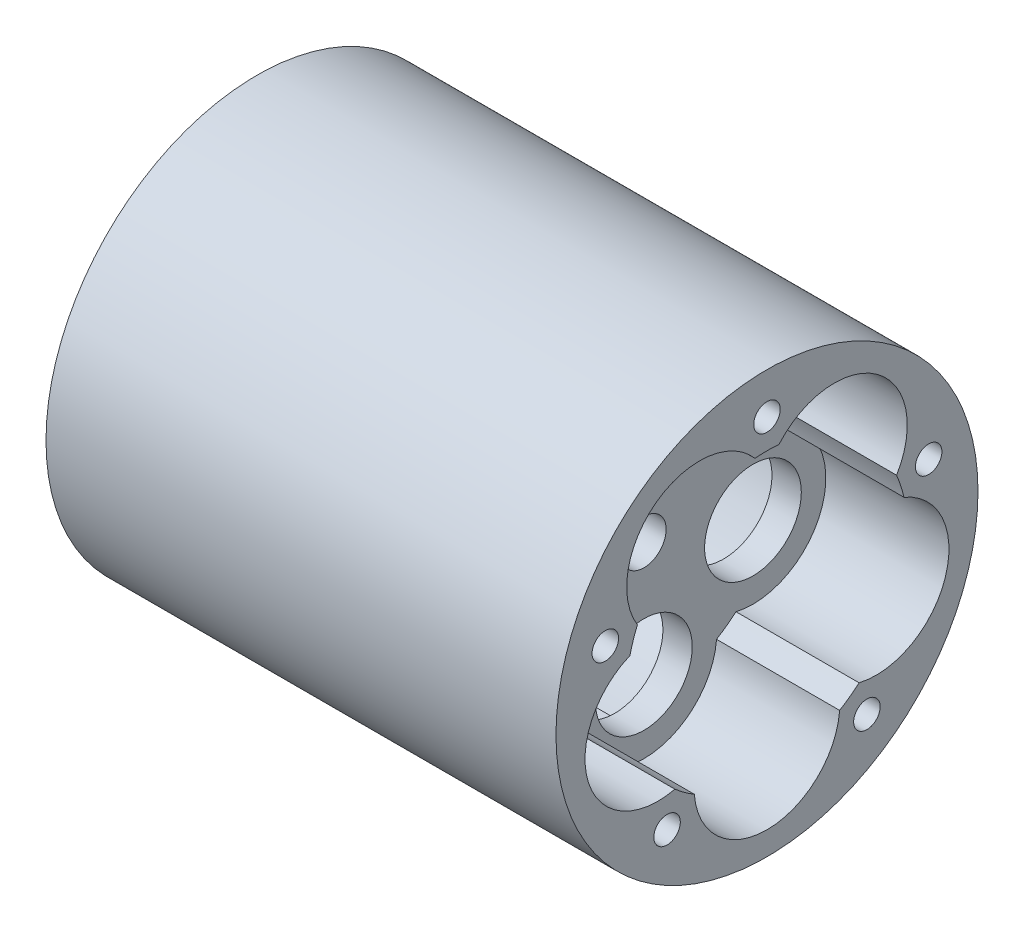
ISO-10303-21;
HEADER;
FILE_DESCRIPTION(('STEP AP214'),'2;1');
FILE_NAME('part.step','',(''),(''),'','','');
FILE_SCHEMA(('AUTOMOTIVE_DESIGN { 1 0 10303 214 1 1 1 1 }'));
ENDSEC;
DATA;
#1=APPLICATION_CONTEXT('core data for automotive mechanical design processes');
#2=APPLICATION_PROTOCOL_DEFINITION('international standard','automotive_design',2000,#1);
#3=PRODUCT_CONTEXT('',#1,'mechanical');
#4=PRODUCT('Part','Part','',(#3));
#5=PRODUCT_RELATED_PRODUCT_CATEGORY('part','',(#4));
#6=PRODUCT_DEFINITION_FORMATION('','',#4);
#7=PRODUCT_DEFINITION_CONTEXT('part definition',#1,'design');
#8=PRODUCT_DEFINITION('design','',#6,#7);
#9=PRODUCT_DEFINITION_SHAPE('','',#8);
#10=(LENGTH_UNIT() NAMED_UNIT(*) SI_UNIT(.MILLI.,.METRE.));
#11=(NAMED_UNIT(*) PLANE_ANGLE_UNIT() SI_UNIT($,.RADIAN.));
#12=(NAMED_UNIT(*) SI_UNIT($,.STERADIAN.) SOLID_ANGLE_UNIT());
#13=UNCERTAINTY_MEASURE_WITH_UNIT(LENGTH_MEASURE(1.E-05),#10,'distance_accuracy_value','');
#14=(GEOMETRIC_REPRESENTATION_CONTEXT(3) GLOBAL_UNCERTAINTY_ASSIGNED_CONTEXT((#13)) GLOBAL_UNIT_ASSIGNED_CONTEXT((#10,
#11,#12)) REPRESENTATION_CONTEXT('',''));
#15=CARTESIAN_POINT('',(0.,0.,0.));
#16=DIRECTION('',(0.,0.,1.));
#17=DIRECTION('',(1.,0.,0.));
#18=AXIS2_PLACEMENT_3D('',#15,#16,#17);
#19=CARTESIAN_POINT('',(2.5,0.,0.));
#20=DIRECTION('',(1.,0.,0.));
#21=DIRECTION('',(0.,0.,-1.));
#22=AXIS2_PLACEMENT_3D('',#19,#20,#21);
#23=PLANE('',#22);
#24=CARTESIAN_POINT('',(2.5,-3.02295389468494,9.30369543531195));
#25=DIRECTION('',(1.,0.,0.));
#26=DIRECTION('',(0.,0.,-1.));
#27=AXIS2_PLACEMENT_3D('',#24,#25,#26);
#28=CIRCLE('',#27,4.125);
#29=CARTESIAN_POINT('',(2.5,-3.02295389468494,5.17869543531195));
#30=VERTEX_POINT('',#29);
#31=EDGE_CURVE('E308',#30,#30,#28,.T.);
#32=ORIENTED_EDGE('',*,*,#31,.F.);
#33=EDGE_LOOP('',(#32));
#34=FACE_BOUND('',#33,.T.);
#35=CARTESIAN_POINT('',(2.5,-3.02295389468507,-9.30369543531191));
#36=DIRECTION('',(1.,0.,0.));
#37=DIRECTION('',(0.,0.,-1.));
#38=AXIS2_PLACEMENT_3D('',#35,#36,#37);
#39=CIRCLE('',#38,4.125);
#40=CARTESIAN_POINT('',(2.5,-3.02295389468507,-13.4286954353119));
#41=VERTEX_POINT('',#40);
#42=EDGE_CURVE('E320',#41,#41,#39,.T.);
#43=ORIENTED_EDGE('',*,*,#42,.F.);
#44=EDGE_LOOP('',(#43));
#45=FACE_BOUND('',#44,.T.);
#46=CARTESIAN_POINT('',(2.5,7.91419604270934,5.74999999999992));
#47=DIRECTION('',(1.,0.,0.));
#48=DIRECTION('',(0.,0.,-1.));
#49=AXIS2_PLACEMENT_3D('',#46,#47,#48);
#50=CIRCLE('',#49,4.125);
#51=CARTESIAN_POINT('',(2.5,7.91419604270934,1.62499999999992));
#52=VERTEX_POINT('',#51);
#53=EDGE_CURVE('E332',#52,#52,#50,.T.);
#54=ORIENTED_EDGE('',*,*,#53,.F.);
#55=EDGE_LOOP('',(#54));
#56=FACE_BOUND('',#55,.T.);
#57=CARTESIAN_POINT('',(2.5,7.91419604270922,-5.75000000000008));
#58=DIRECTION('',(1.,0.,0.));
#59=DIRECTION('',(0.,0.,-1.));
#60=AXIS2_PLACEMENT_3D('',#57,#58,#59);
#61=CIRCLE('',#60,4.125);
#62=CARTESIAN_POINT('',(2.5,7.91419604270922,-9.87500000000008));
#63=VERTEX_POINT('',#62);
#64=EDGE_CURVE('E326',#63,#63,#61,.T.);
#65=ORIENTED_EDGE('',*,*,#64,.F.);
#66=EDGE_LOOP('',(#65));
#67=FACE_BOUND('',#66,.T.);
#68=CARTESIAN_POINT('',(2.5,-9.78248429604849,0.));
#69=DIRECTION('',(1.,0.,0.));
#70=DIRECTION('',(0.,0.,-1.));
#71=AXIS2_PLACEMENT_3D('',#68,#69,#70);
#72=CIRCLE('',#71,4.125);
#73=CARTESIAN_POINT('',(2.5,-9.78248429604849,-4.125));
#74=VERTEX_POINT('',#73);
#75=EDGE_CURVE('E314',#74,#74,#72,.T.);
#76=ORIENTED_EDGE('',*,*,#75,.F.);
#77=EDGE_LOOP('',(#76));
#78=FACE_BOUND('',#77,.T.);
#79=CARTESIAN_POINT('',(2.5,0.,0.));
#80=DIRECTION('',(1.,0.,0.));
#81=DIRECTION('',(0.,0.,-1.));
#82=AXIS2_PLACEMENT_3D('',#79,#80,#81);
#83=CIRCLE('',#82,1.89865);
#84=CARTESIAN_POINT('',(2.5,0.,-1.89865));
#85=VERTEX_POINT('',#84);
#86=EDGE_CURVE('E294',#85,#85,#83,.T.);
#87=ORIENTED_EDGE('',*,*,#86,.F.);
#88=EDGE_LOOP('',(#87));
#89=FACE_BOUND('',#88,.T.);
#90=CARTESIAN_POINT('',(2.5,5.5,0.));
#91=DIRECTION('',(1.,0.,0.));
#92=DIRECTION('',(0.,0.,-1.));
#93=AXIS2_PLACEMENT_3D('',#90,#91,#92);
#94=CIRCLE('',#93,0.75);
#95=CARTESIAN_POINT('',(2.5,5.5,-0.75));
#96=VERTEX_POINT('',#95);
#97=EDGE_CURVE('E258',#96,#96,#94,.T.);
#98=ORIENTED_EDGE('',*,*,#97,.F.);
#99=EDGE_LOOP('',(#98));
#100=FACE_BOUND('',#99,.T.);
#101=CARTESIAN_POINT('',(2.5,0.,0.));
#102=DIRECTION('',(1.,0.,0.));
#103=DIRECTION('',(0.,0.,-1.));
#104=AXIS2_PLACEMENT_3D('',#101,#102,#103);
#105=CIRCLE('',#104,12.);
#106=CARTESIAN_POINT('',(2.5,2.71929195055132,-11.6878334727898));
#107=VERTEX_POINT('',#106);
#108=CARTESIAN_POINT('',(2.5,4.66998274589303,-11.0540156121231));
#109=VERTEX_POINT('',#108);
#110=EDGE_CURVE('E186',#107,#109,#105,.T.);
#111=ORIENTED_EDGE('',*,*,#110,.T.);
#112=CARTESIAN_POINT('',(2.5,7.91419604270922,-5.75000000000008));
#113=DIRECTION('',(1.,0.,0.));
#114=DIRECTION('',(0.,0.,-1.));
#115=AXIS2_PLACEMENT_3D('',#112,#113,#114);
#116=CIRCLE('',#115,6.21751570395152);
#117=CARTESIAN_POINT('',(2.5,11.9560976110568,-1.02553884123568));
#118=VERTEX_POINT('',#117);
#119=EDGE_CURVE('E76',#109,#118,#116,.T.);
#120=ORIENTED_EDGE('',*,*,#119,.T.);
#121=CARTESIAN_POINT('',(2.5,0.,0.));
#122=DIRECTION('',(1.,0.,0.));
#123=DIRECTION('',(0.,0.,-1.));
#124=AXIS2_PLACEMENT_3D('',#121,#122,#123);
#125=CIRCLE('',#124,12.);
#126=CARTESIAN_POINT('',(2.5,11.9560976110568,1.02553884123544));
#127=VERTEX_POINT('',#126);
#128=EDGE_CURVE('E81',#118,#127,#125,.T.);
#129=ORIENTED_EDGE('',*,*,#128,.T.);
#130=CARTESIAN_POINT('',(2.5,7.91419604270934,5.74999999999992));
#131=DIRECTION('',(1.,0.,0.));
#132=DIRECTION('',(0.,0.,-1.));
#133=AXIS2_PLACEMENT_3D('',#130,#131,#132);
#134=CIRCLE('',#133,6.21751570395151);
#135=CARTESIAN_POINT('',(2.5,4.66998274589327,11.054015612123));
#136=VERTEX_POINT('',#135);
#137=EDGE_CURVE('E179',#127,#136,#134,.T.);
#138=ORIENTED_EDGE('',*,*,#137,.T.);
#139=CARTESIAN_POINT('',(2.5,0.,0.));
#140=DIRECTION('',(1.,0.,0.));
#141=DIRECTION('',(0.,0.,-1.));
#142=AXIS2_PLACEMENT_3D('',#139,#140,#141);
#143=CIRCLE('',#142,12.);
#144=CARTESIAN_POINT('',(2.5,2.71929195055148,11.6878334727898));
#145=VERTEX_POINT('',#144);
#146=EDGE_CURVE('E220',#136,#145,#143,.T.);
#147=ORIENTED_EDGE('',*,*,#146,.T.);
#148=CARTESIAN_POINT('',(2.5,-3.02295389468494,9.30369543531195));
#149=DIRECTION('',(1.,0.,0.));
#150=DIRECTION('',(0.,0.,-1.));
#151=AXIS2_PLACEMENT_3D('',#148,#149,#150);
#152=CIRCLE('',#151,6.21751570395151);
#153=CARTESIAN_POINT('',(2.5,-9.06988954721917,7.8572962016997));
#154=VERTEX_POINT('',#153);
#155=EDGE_CURVE('E243',#145,#154,#152,.T.);
#156=ORIENTED_EDGE('',*,*,#155,.T.);
#157=CARTESIAN_POINT('',(2.5,0.,0.));
#158=DIRECTION('',(1.,0.,0.));
#159=DIRECTION('',(0.,0.,-1.));
#160=AXIS2_PLACEMENT_3D('',#157,#158,#159);
#161=CIRCLE('',#160,12.);
#162=CARTESIAN_POINT('',(2.5,-10.275482760282,6.19793949979726));
#163=VERTEX_POINT('',#162);
#164=EDGE_CURVE('E207',#154,#163,#161,.T.);
#165=ORIENTED_EDGE('',*,*,#164,.T.);
#166=CARTESIAN_POINT('',(2.5,-9.78248429604849,0.));
#167=DIRECTION('',(1.,0.,0.));
#168=DIRECTION('',(0.,0.,-1.));
#169=AXIS2_PLACEMENT_3D('',#166,#167,#168);
#170=CIRCLE('',#169,6.21751570395151);
#171=CARTESIAN_POINT('',(2.5,-10.275482760282,-6.19793949979726));
#172=VERTEX_POINT('',#171);
#173=EDGE_CURVE('E229',#163,#172,#170,.T.);
#174=ORIENTED_EDGE('',*,*,#173,.T.);
#175=CARTESIAN_POINT('',(2.5,0.,0.));
#176=DIRECTION('',(1.,0.,0.));
#177=DIRECTION('',(0.,0.,-1.));
#178=AXIS2_PLACEMENT_3D('',#175,#176,#177);
#179=CIRCLE('',#178,12.);
#180=CARTESIAN_POINT('',(2.5,-9.06988954721927,-7.85729620169957));
#181=VERTEX_POINT('',#180);
#182=EDGE_CURVE('E189',#172,#181,#179,.T.);
#183=ORIENTED_EDGE('',*,*,#182,.T.);
#184=CARTESIAN_POINT('',(2.5,-3.02295389468507,-9.30369543531191));
#185=DIRECTION('',(1.,0.,0.));
#186=DIRECTION('',(0.,0.,-1.));
#187=AXIS2_PLACEMENT_3D('',#184,#185,#186);
#188=CIRCLE('',#187,6.21751570395151);
#189=EDGE_CURVE('E193',#181,#107,#188,.T.);
#190=ORIENTED_EDGE('',*,*,#189,.T.);
#191=EDGE_LOOP('',(#111,#120,#129,#138,#147,#156,#165,#174,#183,#190));
#192=FACE_BOUND('',#191,.T.);
#193=ADVANCED_FACE('F60',(#34,#45,#56,#67,#78,#89,#100,#192),#23,.T.);
#194=CARTESIAN_POINT('',(0.,0.,0.));
#195=DIRECTION('',(1.,0.,0.));
#196=DIRECTION('',(0.,0.,-1.));
#197=AXIS2_PLACEMENT_3D('',#194,#195,#196);
#198=PLANE('',#197);
#199=CARTESIAN_POINT('',(0.,4.4807464184368,-13.7903194862797));
#200=DIRECTION('',(1.,0.,0.));
#201=DIRECTION('',(0.,0.,-1.));
#202=AXIS2_PLACEMENT_3D('',#199,#200,#201);
#203=CIRCLE('',#202,1.1303);
#204=CARTESIAN_POINT('',(0.,4.4807464184368,-14.9206194862797));
#205=VERTEX_POINT('',#204);
#206=EDGE_CURVE('E507',#205,#205,#203,.T.);
#207=ORIENTED_EDGE('',*,*,#206,.T.);
#208=EDGE_LOOP('',(#207));
#209=FACE_BOUND('',#208,.T.);
#210=CARTESIAN_POINT('',(0.,-11.7307464184367,-8.52288615824097));
#211=DIRECTION('',(1.,0.,0.));
#212=DIRECTION('',(0.,0.,-1.));
#213=AXIS2_PLACEMENT_3D('',#210,#211,#212);
#214=CIRCLE('',#213,1.1303);
#215=CARTESIAN_POINT('',(0.,-11.7307464184367,-9.65318615824097));
#216=VERTEX_POINT('',#215);
#217=EDGE_CURVE('E508',#216,#216,#214,.T.);
#218=ORIENTED_EDGE('',*,*,#217,.T.);
#219=EDGE_LOOP('',(#218));
#220=FACE_BOUND('',#219,.T.);
#221=CARTESIAN_POINT('',(0.,-11.7307464184369,8.5228861582407));
#222=DIRECTION('',(1.,0.,0.));
#223=DIRECTION('',(0.,0.,-1.));
#224=AXIS2_PLACEMENT_3D('',#221,#222,#223);
#225=CIRCLE('',#224,1.1303);
#226=CARTESIAN_POINT('',(0.,-11.7307464184369,7.3925861582407));
#227=VERTEX_POINT('',#226);
#228=EDGE_CURVE('E512',#227,#227,#225,.T.);
#229=ORIENTED_EDGE('',*,*,#228,.T.);
#230=EDGE_LOOP('',(#229));
#231=FACE_BOUND('',#230,.T.);
#232=CARTESIAN_POINT('',(0.,4.48074641843649,13.7903194862798));
#233=DIRECTION('',(1.,0.,0.));
#234=DIRECTION('',(0.,0.,-1.));
#235=AXIS2_PLACEMENT_3D('',#232,#233,#234);
#236=CIRCLE('',#235,1.1303);
#237=CARTESIAN_POINT('',(0.,4.48074641843649,12.6600194862798));
#238=VERTEX_POINT('',#237);
#239=EDGE_CURVE('E517',#238,#238,#236,.T.);
#240=ORIENTED_EDGE('',*,*,#239,.T.);
#241=EDGE_LOOP('',(#240));
#242=FACE_BOUND('',#241,.T.);
#243=CARTESIAN_POINT('',(0.,14.5,0.));
#244=DIRECTION('',(1.,0.,0.));
#245=DIRECTION('',(0.,0.,-1.));
#246=AXIS2_PLACEMENT_3D('',#243,#244,#245);
#247=CIRCLE('',#246,1.1303);
#248=CARTESIAN_POINT('',(0.,14.5,-1.1303));
#249=VERTEX_POINT('',#248);
#250=EDGE_CURVE('E196',#249,#249,#247,.T.);
#251=ORIENTED_EDGE('',*,*,#250,.T.);
#252=EDGE_LOOP('',(#251));
#253=FACE_BOUND('',#252,.T.);
#254=CARTESIAN_POINT('',(0.,5.5,0.));
#255=DIRECTION('',(1.,0.,0.));
#256=DIRECTION('',(0.,0.,-1.));
#257=AXIS2_PLACEMENT_3D('',#254,#255,#256);
#258=CIRCLE('',#257,0.75);
#259=CARTESIAN_POINT('',(0.,5.5,-0.75));
#260=VERTEX_POINT('',#259);
#261=EDGE_CURVE('E64',#260,#260,#258,.T.);
#262=ORIENTED_EDGE('',*,*,#261,.T.);
#263=EDGE_LOOP('',(#262));
#264=FACE_BOUND('',#263,.T.);
#265=CARTESIAN_POINT('',(0.,0.,0.));
#266=DIRECTION('',(1.,0.,0.));
#267=DIRECTION('',(0.,0.,-1.));
#268=AXIS2_PLACEMENT_3D('',#265,#266,#267);
#269=CIRCLE('',#268,1.89865);
#270=CARTESIAN_POINT('',(0.,0.,-1.89865));
#271=VERTEX_POINT('',#270);
#272=EDGE_CURVE('E297',#271,#271,#269,.T.);
#273=ORIENTED_EDGE('',*,*,#272,.T.);
#274=EDGE_LOOP('',(#273));
#275=FACE_BOUND('',#274,.T.);
#276=DIRECTION('',(0.,-0.707106781186548,0.707106781186547));
#277=VECTOR('',#276,1.);
#278=CARTESIAN_POINT('',(0.,-7.12499999999999,-7.125));
#279=LINE('',#278,#277);
#280=CARTESIAN_POINT('',(0.,-14.75,0.5));
#281=VERTEX_POINT('',#280);
#282=CARTESIAN_POINT('',(0.,-15.,0.75));
#283=VERTEX_POINT('',#282);
#284=EDGE_CURVE('E285',#281,#283,#279,.T.);
#285=ORIENTED_EDGE('',*,*,#284,.T.);
#286=DIRECTION('',(0.,-1.,0.));
#287=VECTOR('',#286,1.);
#288=CARTESIAN_POINT('',(0.,0.,0.75));
#289=LINE('',#288,#287);
#290=CARTESIAN_POINT('',(0.,-15.9824122084246,0.75));
#291=VERTEX_POINT('',#290);
#292=EDGE_CURVE('E291',#283,#291,#289,.T.);
#293=ORIENTED_EDGE('',*,*,#292,.T.);
#294=CARTESIAN_POINT('',(0.,0.,0.));
#295=DIRECTION('',(1.,0.,0.));
#296=DIRECTION('',(0.,0.,-1.));
#297=AXIS2_PLACEMENT_3D('',#294,#295,#296);
#298=CIRCLE('',#297,16.);
#299=CARTESIAN_POINT('',(0.,-15.9824122084246,-0.75));
#300=VERTEX_POINT('',#299);
#301=EDGE_CURVE('E335',#300,#291,#298,.T.);
#302=ORIENTED_EDGE('',*,*,#301,.F.);
#303=DIRECTION('',(0.,1.,0.));
#304=VECTOR('',#303,1.);
#305=CARTESIAN_POINT('',(0.,0.,-0.75));
#306=LINE('',#305,#304);
#307=CARTESIAN_POINT('',(0.,-15.,-0.75));
#308=VERTEX_POINT('',#307);
#309=EDGE_CURVE('E276',#300,#308,#306,.T.);
#310=ORIENTED_EDGE('',*,*,#309,.T.);
#311=DIRECTION('',(0.,0.707106781186548,0.707106781186547));
#312=VECTOR('',#311,1.);
#313=CARTESIAN_POINT('',(0.,-7.12499999999999,7.125));
#314=LINE('',#313,#312);
#315=CARTESIAN_POINT('',(0.,-14.75,-0.5));
#316=VERTEX_POINT('',#315);
#317=EDGE_CURVE('E279',#308,#316,#314,.T.);
#318=ORIENTED_EDGE('',*,*,#317,.T.);
#319=DIRECTION('',(0.,0.,1.));
#320=VECTOR('',#319,1.);
#321=CARTESIAN_POINT('',(0.,-14.75,0.));
#322=LINE('',#321,#320);
#323=EDGE_CURVE('E282',#316,#281,#322,.T.);
#324=ORIENTED_EDGE('',*,*,#323,.T.);
#325=EDGE_LOOP('',(#285,#293,#302,#310,#318,#324));
#326=FACE_BOUND('',#325,.T.);
#327=CARTESIAN_POINT('',(0.,7.91419604270934,5.74999999999992));
#328=DIRECTION('',(1.,0.,0.));
#329=DIRECTION('',(0.,0.,-1.));
#330=AXIS2_PLACEMENT_3D('',#327,#328,#329);
#331=CIRCLE('',#330,4.125);
#332=CARTESIAN_POINT('',(0.,7.91419604270934,1.62499999999992));
#333=VERTEX_POINT('',#332);
#334=EDGE_CURVE('E329',#333,#333,#331,.T.);
#335=ORIENTED_EDGE('',*,*,#334,.T.);
#336=EDGE_LOOP('',(#335));
#337=FACE_BOUND('',#336,.T.);
#338=CARTESIAN_POINT('',(0.,7.91419604270922,-5.75000000000008));
#339=DIRECTION('',(1.,0.,0.));
#340=DIRECTION('',(0.,0.,-1.));
#341=AXIS2_PLACEMENT_3D('',#338,#339,#340);
#342=CIRCLE('',#341,4.125);
#343=CARTESIAN_POINT('',(0.,7.91419604270922,-9.87500000000008));
#344=VERTEX_POINT('',#343);
#345=EDGE_CURVE('E323',#344,#344,#342,.T.);
#346=ORIENTED_EDGE('',*,*,#345,.T.);
#347=EDGE_LOOP('',(#346));
#348=FACE_BOUND('',#347,.T.);
#349=CARTESIAN_POINT('',(0.,-3.02295389468507,-9.30369543531191));
#350=DIRECTION('',(1.,0.,0.));
#351=DIRECTION('',(0.,0.,-1.));
#352=AXIS2_PLACEMENT_3D('',#349,#350,#351);
#353=CIRCLE('',#352,4.125);
#354=CARTESIAN_POINT('',(0.,-3.02295389468507,-13.4286954353119));
#355=VERTEX_POINT('',#354);
#356=EDGE_CURVE('E317',#355,#355,#353,.T.);
#357=ORIENTED_EDGE('',*,*,#356,.T.);
#358=EDGE_LOOP('',(#357));
#359=FACE_BOUND('',#358,.T.);
#360=CARTESIAN_POINT('',(0.,-9.78248429604849,0.));
#361=DIRECTION('',(1.,0.,0.));
#362=DIRECTION('',(0.,0.,-1.));
#363=AXIS2_PLACEMENT_3D('',#360,#361,#362);
#364=CIRCLE('',#363,4.125);
#365=CARTESIAN_POINT('',(0.,-9.78248429604849,-4.125));
#366=VERTEX_POINT('',#365);
#367=EDGE_CURVE('E311',#366,#366,#364,.T.);
#368=ORIENTED_EDGE('',*,*,#367,.T.);
#369=EDGE_LOOP('',(#368));
#370=FACE_BOUND('',#369,.T.);
#371=CARTESIAN_POINT('',(0.,-3.02295389468494,9.30369543531195));
#372=DIRECTION('',(1.,0.,0.));
#373=DIRECTION('',(0.,0.,-1.));
#374=AXIS2_PLACEMENT_3D('',#371,#372,#373);
#375=CIRCLE('',#374,4.125);
#376=CARTESIAN_POINT('',(0.,-3.02295389468494,5.17869543531195));
#377=VERTEX_POINT('',#376);
#378=EDGE_CURVE('E307',#377,#377,#375,.T.);
#379=ORIENTED_EDGE('',*,*,#378,.T.);
#380=EDGE_LOOP('',(#379));
#381=FACE_BOUND('',#380,.T.);
#382=ADVANCED_FACE('F62',(#209,#220,#231,#242,#253,#264,#275,#326,#337,#348,#359,#370,#381),
#198,.F.);
#383=CARTESIAN_POINT('',(2.5,7.91419604270934,5.74999999999992));
#384=DIRECTION('',(-1.,0.,0.));
#385=DIRECTION('',(0.,0.,1.));
#386=AXIS2_PLACEMENT_3D('',#383,#384,#385);
#387=CYLINDRICAL_SURFACE('',#386,4.125);
#388=ORIENTED_EDGE('',*,*,#53,.T.);
#389=EDGE_LOOP('',(#388));
#390=FACE_BOUND('',#389,.T.);
#391=ORIENTED_EDGE('',*,*,#334,.F.);
#392=EDGE_LOOP('',(#391));
#393=FACE_BOUND('',#392,.T.);
#394=ADVANCED_FACE('F387',(#390,#393),#387,.F.);
#395=CARTESIAN_POINT('',(2.5,7.91419604270922,-5.75000000000008));
#396=DIRECTION('',(-1.,0.,0.));
#397=DIRECTION('',(0.,0.,1.));
#398=AXIS2_PLACEMENT_3D('',#395,#396,#397);
#399=CYLINDRICAL_SURFACE('',#398,4.125);
#400=ORIENTED_EDGE('',*,*,#64,.T.);
#401=EDGE_LOOP('',(#400));
#402=FACE_BOUND('',#401,.T.);
#403=ORIENTED_EDGE('',*,*,#345,.F.);
#404=EDGE_LOOP('',(#403));
#405=FACE_BOUND('',#404,.T.);
#406=ADVANCED_FACE('F394',(#402,#405),#399,.F.);
#407=CARTESIAN_POINT('',(2.5,-3.02295389468507,-9.30369543531191));
#408=DIRECTION('',(-1.,0.,0.));
#409=DIRECTION('',(0.,0.,1.));
#410=AXIS2_PLACEMENT_3D('',#407,#408,#409);
#411=CYLINDRICAL_SURFACE('',#410,4.125);
#412=ORIENTED_EDGE('',*,*,#42,.T.);
#413=EDGE_LOOP('',(#412));
#414=FACE_BOUND('',#413,.T.);
#415=ORIENTED_EDGE('',*,*,#356,.F.);
#416=EDGE_LOOP('',(#415));
#417=FACE_BOUND('',#416,.T.);
#418=ADVANCED_FACE('F398',(#414,#417),#411,.F.);
#419=CARTESIAN_POINT('',(2.5,-9.78248429604849,0.));
#420=DIRECTION('',(-1.,0.,0.));
#421=DIRECTION('',(0.,0.,1.));
#422=AXIS2_PLACEMENT_3D('',#419,#420,#421);
#423=CYLINDRICAL_SURFACE('',#422,4.125);
#424=ORIENTED_EDGE('',*,*,#75,.T.);
#425=EDGE_LOOP('',(#424));
#426=FACE_BOUND('',#425,.T.);
#427=ORIENTED_EDGE('',*,*,#367,.F.);
#428=EDGE_LOOP('',(#427));
#429=FACE_BOUND('',#428,.T.);
#430=ADVANCED_FACE('F402',(#426,#429),#423,.F.);
#431=CARTESIAN_POINT('',(2.5,-3.02295389468494,9.30369543531195));
#432=DIRECTION('',(-1.,0.,0.));
#433=DIRECTION('',(0.,0.,1.));
#434=AXIS2_PLACEMENT_3D('',#431,#432,#433);
#435=CYLINDRICAL_SURFACE('',#434,4.125);
#436=ORIENTED_EDGE('',*,*,#31,.T.);
#437=EDGE_LOOP('',(#436));
#438=FACE_BOUND('',#437,.T.);
#439=ORIENTED_EDGE('',*,*,#378,.F.);
#440=EDGE_LOOP('',(#439));
#441=FACE_BOUND('',#440,.T.);
#442=ADVANCED_FACE('F406',(#438,#441),#435,.F.);
#443=CARTESIAN_POINT('',(-27.5,0.,0.));
#444=DIRECTION('',(1.,0.,0.));
#445=DIRECTION('',(0.,0.,-1.));
#446=AXIS2_PLACEMENT_3D('',#443,#444,#445);
#447=CYLINDRICAL_SURFACE('',#446,16.);
#448=ORIENTED_EDGE('',*,*,#301,.T.);
#449=DIRECTION('',(1.,0.,0.));
#450=VECTOR('',#449,1.);
#451=CARTESIAN_POINT('',(-27.5,-15.9824122084246,0.75));
#452=LINE('',#451,#450);
#453=CARTESIAN_POINT('',(-27.5,-15.9824122084246,0.75));
#454=VERTEX_POINT('',#453);
#455=EDGE_CURVE('E288',#291,#454,#452,.F.);
#456=ORIENTED_EDGE('',*,*,#455,.T.);
#457=CARTESIAN_POINT('',(-27.5,0.,0.));
#458=DIRECTION('',(1.,0.,0.));
#459=DIRECTION('',(0.,0.,-1.));
#460=AXIS2_PLACEMENT_3D('',#457,#458,#459);
#461=CIRCLE('',#460,16.);
#462=CARTESIAN_POINT('',(-27.5,-15.9824122084246,-0.75));
#463=VERTEX_POINT('',#462);
#464=EDGE_CURVE('E304',#463,#454,#461,.T.);
#465=ORIENTED_EDGE('',*,*,#464,.F.);
#466=DIRECTION('',(1.,0.,0.));
#467=VECTOR('',#466,1.);
#468=CARTESIAN_POINT('',(-27.5,-15.9824122084246,-0.75));
#469=LINE('',#468,#467);
#470=EDGE_CURVE('E264',#463,#300,#469,.T.);
#471=ORIENTED_EDGE('',*,*,#470,.T.);
#472=EDGE_LOOP('',(#448,#456,#465,#471));
#473=FACE_BOUND('',#472,.T.);
#474=ADVANCED_FACE('F364',(#473),#447,.F.);
#475=CARTESIAN_POINT('',(-27.5,0.,0.));
#476=DIRECTION('',(1.,0.,0.));
#477=DIRECTION('',(0.,0.,-1.));
#478=AXIS2_PLACEMENT_3D('',#475,#476,#477);
#479=CYLINDRICAL_SURFACE('',#478,18.);
#480=CARTESIAN_POINT('',(13.,0.,0.));
#481=DIRECTION('',(1.,0.,0.));
#482=DIRECTION('',(0.,0.,-1.));
#483=AXIS2_PLACEMENT_3D('',#480,#481,#482);
#484=CIRCLE('',#483,18.);
#485=CARTESIAN_POINT('',(13.,0.,-18.));
#486=VERTEX_POINT('',#485);
#487=EDGE_CURVE('E301',#486,#486,#484,.T.);
#488=ORIENTED_EDGE('',*,*,#487,.F.);
#489=EDGE_LOOP('',(#488));
#490=FACE_BOUND('',#489,.T.);
#491=CARTESIAN_POINT('',(-30.5,0.,0.));
#492=DIRECTION('',(-1.,0.,0.));
#493=DIRECTION('',(0.,0.,1.));
#494=AXIS2_PLACEMENT_3D('',#491,#492,#493);
#495=CIRCLE('',#494,18.);
#496=CARTESIAN_POINT('',(-30.5,0.,18.));
#497=VERTEX_POINT('',#496);
#498=EDGE_CURVE('E298',#497,#497,#495,.T.);
#499=ORIENTED_EDGE('',*,*,#498,.F.);
#500=EDGE_LOOP('',(#499));
#501=FACE_BOUND('',#500,.T.);
#502=ADVANCED_FACE('F411',(#490,#501),#479,.T.);
#503=CARTESIAN_POINT('',(13.,0.,0.));
#504=DIRECTION('',(1.,0.,0.));
#505=DIRECTION('',(0.,0.,-1.));
#506=AXIS2_PLACEMENT_3D('',#503,#504,#505);
#507=PLANE('',#506);
#508=CARTESIAN_POINT('',(13.,4.4807464184368,-13.7903194862797));
#509=DIRECTION('',(1.,0.,0.));
#510=DIRECTION('',(0.,0.,-1.));
#511=AXIS2_PLACEMENT_3D('',#508,#509,#510);
#512=CIRCLE('',#511,1.1303);
#513=CARTESIAN_POINT('',(13.,4.4807464184368,-14.9206194862797));
#514=VERTEX_POINT('',#513);
#515=EDGE_CURVE('E504',#514,#514,#512,.T.);
#516=ORIENTED_EDGE('',*,*,#515,.F.);
#517=EDGE_LOOP('',(#516));
#518=FACE_BOUND('',#517,.T.);
#519=CARTESIAN_POINT('',(13.,-11.7307464184367,-8.52288615824097));
#520=DIRECTION('',(1.,0.,0.));
#521=DIRECTION('',(0.,0.,-1.));
#522=AXIS2_PLACEMENT_3D('',#519,#520,#521);
#523=CIRCLE('',#522,1.1303);
#524=CARTESIAN_POINT('',(13.,-11.7307464184367,-9.65318615824097));
#525=VERTEX_POINT('',#524);
#526=EDGE_CURVE('E526',#525,#525,#523,.T.);
#527=ORIENTED_EDGE('',*,*,#526,.F.);
#528=EDGE_LOOP('',(#527));
#529=FACE_BOUND('',#528,.T.);
#530=CARTESIAN_POINT('',(13.,-11.7307464184369,8.5228861582407));
#531=DIRECTION('',(1.,0.,0.));
#532=DIRECTION('',(0.,0.,-1.));
#533=AXIS2_PLACEMENT_3D('',#530,#531,#532);
#534=CIRCLE('',#533,1.1303);
#535=CARTESIAN_POINT('',(13.,-11.7307464184369,7.3925861582407));
#536=VERTEX_POINT('',#535);
#537=EDGE_CURVE('E523',#536,#536,#534,.T.);
#538=ORIENTED_EDGE('',*,*,#537,.F.);
#539=EDGE_LOOP('',(#538));
#540=FACE_BOUND('',#539,.T.);
#541=CARTESIAN_POINT('',(13.,4.48074641843649,13.7903194862798));
#542=DIRECTION('',(1.,0.,0.));
#543=DIRECTION('',(0.,0.,-1.));
#544=AXIS2_PLACEMENT_3D('',#541,#542,#543);
#545=CIRCLE('',#544,1.1303);
#546=CARTESIAN_POINT('',(13.,4.48074641843649,12.6600194862798));
#547=VERTEX_POINT('',#546);
#548=EDGE_CURVE('E520',#547,#547,#545,.T.);
#549=ORIENTED_EDGE('',*,*,#548,.F.);
#550=EDGE_LOOP('',(#549));
#551=FACE_BOUND('',#550,.T.);
#552=CARTESIAN_POINT('',(13.,14.5,0.));
#553=DIRECTION('',(1.,0.,0.));
#554=DIRECTION('',(0.,0.,-1.));
#555=AXIS2_PLACEMENT_3D('',#552,#553,#554);
#556=CIRCLE('',#555,1.1303);
#557=CARTESIAN_POINT('',(13.,14.5,-1.1303));
#558=VERTEX_POINT('',#557);
#559=EDGE_CURVE('E200',#558,#558,#556,.T.);
#560=ORIENTED_EDGE('',*,*,#559,.F.);
#561=EDGE_LOOP('',(#560));
#562=FACE_BOUND('',#561,.T.);
#563=ORIENTED_EDGE('',*,*,#487,.T.);
#564=EDGE_LOOP('',(#563));
#565=FACE_BOUND('',#564,.T.);
#566=CARTESIAN_POINT('',(13.,7.91419604270922,-5.75000000000008));
#567=DIRECTION('',(1.,0.,0.));
#568=DIRECTION('',(0.,0.,-1.));
#569=AXIS2_PLACEMENT_3D('',#566,#567,#568);
#570=CIRCLE('',#569,6.21751570395152);
#571=CARTESIAN_POINT('',(13.,4.66998274589303,-11.0540156121231));
#572=VERTEX_POINT('',#571);
#573=CARTESIAN_POINT('',(13.,11.9560976110568,-1.02553884123568));
#574=VERTEX_POINT('',#573);
#575=EDGE_CURVE('E250',#572,#574,#570,.T.);
#576=ORIENTED_EDGE('',*,*,#575,.F.);
#577=CARTESIAN_POINT('',(13.,0.,0.));
#578=DIRECTION('',(1.,0.,0.));
#579=DIRECTION('',(0.,0.,-1.));
#580=AXIS2_PLACEMENT_3D('',#577,#578,#579);
#581=CIRCLE('',#580,12.);
#582=CARTESIAN_POINT('',(13.,2.71929195055132,-11.6878334727898));
#583=VERTEX_POINT('',#582);
#584=EDGE_CURVE('E188',#583,#572,#581,.T.);
#585=ORIENTED_EDGE('',*,*,#584,.F.);
#586=CARTESIAN_POINT('',(13.,-3.02295389468507,-9.30369543531191));
#587=DIRECTION('',(1.,0.,0.));
#588=DIRECTION('',(0.,0.,-1.));
#589=AXIS2_PLACEMENT_3D('',#586,#587,#588);
#590=CIRCLE('',#589,6.21751570395151);
#591=CARTESIAN_POINT('',(13.,-9.06988954721927,-7.85729620169957));
#592=VERTEX_POINT('',#591);
#593=EDGE_CURVE('E212',#592,#583,#590,.T.);
#594=ORIENTED_EDGE('',*,*,#593,.F.);
#595=CARTESIAN_POINT('',(13.,0.,0.));
#596=DIRECTION('',(1.,0.,0.));
#597=DIRECTION('',(0.,0.,-1.));
#598=AXIS2_PLACEMENT_3D('',#595,#596,#597);
#599=CIRCLE('',#598,12.);
#600=CARTESIAN_POINT('',(13.,-10.275482760282,-6.19793949979726));
#601=VERTEX_POINT('',#600);
#602=EDGE_CURVE('E208',#601,#592,#599,.T.);
#603=ORIENTED_EDGE('',*,*,#602,.F.);
#604=CARTESIAN_POINT('',(13.,-9.78248429604849,0.));
#605=DIRECTION('',(1.,0.,0.));
#606=DIRECTION('',(0.,0.,-1.));
#607=AXIS2_PLACEMENT_3D('',#604,#605,#606);
#608=CIRCLE('',#607,6.21751570395151);
#609=CARTESIAN_POINT('',(13.,-10.275482760282,6.19793949979726));
#610=VERTEX_POINT('',#609);
#611=EDGE_CURVE('E225',#610,#601,#608,.T.);
#612=ORIENTED_EDGE('',*,*,#611,.F.);
#613=CARTESIAN_POINT('',(13.,0.,0.));
#614=DIRECTION('',(1.,0.,0.));
#615=DIRECTION('',(0.,0.,-1.));
#616=AXIS2_PLACEMENT_3D('',#613,#614,#615);
#617=CIRCLE('',#616,12.);
#618=CARTESIAN_POINT('',(13.,-9.06988954721917,7.8572962016997));
#619=VERTEX_POINT('',#618);
#620=EDGE_CURVE('E221',#619,#610,#617,.T.);
#621=ORIENTED_EDGE('',*,*,#620,.F.);
#622=CARTESIAN_POINT('',(13.,-3.02295389468494,9.30369543531195));
#623=DIRECTION('',(1.,0.,0.));
#624=DIRECTION('',(0.,0.,-1.));
#625=AXIS2_PLACEMENT_3D('',#622,#623,#624);
#626=CIRCLE('',#625,6.21751570395151);
#627=CARTESIAN_POINT('',(13.,2.71929195055148,11.6878334727898));
#628=VERTEX_POINT('',#627);
#629=EDGE_CURVE('E239',#628,#619,#626,.T.);
#630=ORIENTED_EDGE('',*,*,#629,.F.);
#631=CARTESIAN_POINT('',(13.,0.,0.));
#632=DIRECTION('',(1.,0.,0.));
#633=DIRECTION('',(0.,0.,-1.));
#634=AXIS2_PLACEMENT_3D('',#631,#632,#633);
#635=CIRCLE('',#634,12.);
#636=CARTESIAN_POINT('',(13.,4.66998274589327,11.054015612123));
#637=VERTEX_POINT('',#636);
#638=EDGE_CURVE('E235',#637,#628,#635,.T.);
#639=ORIENTED_EDGE('',*,*,#638,.F.);
#640=CARTESIAN_POINT('',(13.,7.91419604270934,5.74999999999992));
#641=DIRECTION('',(1.,0.,0.));
#642=DIRECTION('',(0.,0.,-1.));
#643=AXIS2_PLACEMENT_3D('',#640,#641,#642);
#644=CIRCLE('',#643,6.21751570395151);
#645=CARTESIAN_POINT('',(13.,11.9560976110568,1.02553884123544));
#646=VERTEX_POINT('',#645);
#647=EDGE_CURVE('E178',#646,#637,#644,.T.);
#648=ORIENTED_EDGE('',*,*,#647,.F.);
#649=CARTESIAN_POINT('',(13.,0.,0.));
#650=DIRECTION('',(1.,0.,0.));
#651=DIRECTION('',(0.,0.,-1.));
#652=AXIS2_PLACEMENT_3D('',#649,#650,#651);
#653=CIRCLE('',#652,12.);
#654=EDGE_CURVE('E251',#574,#646,#653,.T.);
#655=ORIENTED_EDGE('',*,*,#654,.F.);
#656=EDGE_LOOP('',(#576,#585,#594,#603,#612,#621,#630,#639,#648,#655));
#657=FACE_BOUND('',#656,.T.);
#658=ADVANCED_FACE('F414',(#518,#529,#540,#551,#562,#565,#657),#507,.T.);
#659=CARTESIAN_POINT('',(-30.5,0.,0.));
#660=DIRECTION('',(-1.,0.,0.));
#661=DIRECTION('',(0.,0.,1.));
#662=AXIS2_PLACEMENT_3D('',#659,#660,#661);
#663=PLANE('',#662);
#664=ORIENTED_EDGE('',*,*,#498,.T.);
#665=EDGE_LOOP('',(#664));
#666=FACE_BOUND('',#665,.T.);
#667=ADVANCED_FACE('F420',(#666),#663,.T.);
#668=CARTESIAN_POINT('',(-27.5,0.,0.));
#669=DIRECTION('',(-1.,0.,0.));
#670=DIRECTION('',(0.,0.,1.));
#671=AXIS2_PLACEMENT_3D('',#668,#669,#670);
#672=PLANE('',#671);
#673=ORIENTED_EDGE('',*,*,#464,.T.);
#674=DIRECTION('',(0.,1.,0.));
#675=VECTOR('',#674,1.);
#676=CARTESIAN_POINT('',(-27.5,0.,0.75));
#677=LINE('',#676,#675);
#678=CARTESIAN_POINT('',(-27.5,-15.,0.75));
#679=VERTEX_POINT('',#678);
#680=EDGE_CURVE('E12',#454,#679,#677,.T.);
#681=ORIENTED_EDGE('',*,*,#680,.T.);
#682=DIRECTION('',(0.,0.707106781186548,-0.707106781186547));
#683=VECTOR('',#682,1.);
#684=CARTESIAN_POINT('',(-27.5,-7.12499999999999,-7.125));
#685=LINE('',#684,#683);
#686=CARTESIAN_POINT('',(-27.5,-14.75,0.5));
#687=VERTEX_POINT('',#686);
#688=EDGE_CURVE('E69',#679,#687,#685,.T.);
#689=ORIENTED_EDGE('',*,*,#688,.T.);
#690=DIRECTION('',(0.,0.,-1.));
#691=VECTOR('',#690,1.);
#692=CARTESIAN_POINT('',(-27.5,-14.75,0.));
#693=LINE('',#692,#691);
#694=CARTESIAN_POINT('',(-27.5,-14.75,-0.5));
#695=VERTEX_POINT('',#694);
#696=EDGE_CURVE('E348',#687,#695,#693,.T.);
#697=ORIENTED_EDGE('',*,*,#696,.T.);
#698=DIRECTION('',(0.,-0.707106781186548,-0.707106781186547));
#699=VECTOR('',#698,1.);
#700=CARTESIAN_POINT('',(-27.5,-7.12499999999999,7.125));
#701=LINE('',#700,#699);
#702=CARTESIAN_POINT('',(-27.5,-15.,-0.75));
#703=VERTEX_POINT('',#702);
#704=EDGE_CURVE('E345',#695,#703,#701,.T.);
#705=ORIENTED_EDGE('',*,*,#704,.T.);
#706=DIRECTION('',(0.,-1.,0.));
#707=VECTOR('',#706,1.);
#708=CARTESIAN_POINT('',(-27.5,0.,-0.75));
#709=LINE('',#708,#707);
#710=EDGE_CURVE('E340',#703,#463,#709,.T.);
#711=ORIENTED_EDGE('',*,*,#710,.T.);
#712=EDGE_LOOP('',(#673,#681,#689,#697,#705,#711));
#713=FACE_BOUND('',#712,.T.);
#714=ADVANCED_FACE('F353',(#713),#672,.F.);
#715=CARTESIAN_POINT('',(-0.5,0.,0.));
#716=DIRECTION('',(1.,0.,0.));
#717=DIRECTION('',(0.,0.,-1.));
#718=AXIS2_PLACEMENT_3D('',#715,#716,#717);
#719=CYLINDRICAL_SURFACE('',#718,1.89865);
#720=ORIENTED_EDGE('',*,*,#86,.T.);
#721=EDGE_LOOP('',(#720));
#722=FACE_BOUND('',#721,.T.);
#723=ORIENTED_EDGE('',*,*,#272,.F.);
#724=EDGE_LOOP('',(#723));
#725=FACE_BOUND('',#724,.T.);
#726=ADVANCED_FACE('F424',(#722,#725),#719,.F.);
#727=CARTESIAN_POINT('',(-28.5,-16.25,0.75));
#728=DIRECTION('',(0.,0.,1.));
#729=DIRECTION('',(1.,0.,0.));
#730=AXIS2_PLACEMENT_3D('',#727,#728,#729);
#731=PLANE('',#730);
#732=ORIENTED_EDGE('',*,*,#292,.F.);
#733=DIRECTION('',(1.,0.,0.));
#734=VECTOR('',#733,1.);
#735=CARTESIAN_POINT('',(-28.5,-15.,0.75));
#736=LINE('',#735,#734);
#737=EDGE_CURVE('E261',#679,#283,#736,.T.);
#738=ORIENTED_EDGE('',*,*,#737,.F.);
#739=ORIENTED_EDGE('',*,*,#680,.F.);
#740=ORIENTED_EDGE('',*,*,#455,.F.);
#741=EDGE_LOOP('',(#732,#738,#739,#740));
#742=FACE_BOUND('',#741,.T.);
#743=ADVANCED_FACE('F359',(#742),#731,.T.);
#744=CARTESIAN_POINT('',(-28.5,-15.,0.75));
#745=DIRECTION('',(0.,0.707106781186547,0.707106781186548));
#746=DIRECTION('',(0.,-0.707106781186548,0.707106781186547));
#747=AXIS2_PLACEMENT_3D('',#744,#745,#746);
#748=PLANE('',#747);
#749=ORIENTED_EDGE('',*,*,#284,.F.);
#750=DIRECTION('',(1.,0.,0.));
#751=VECTOR('',#750,1.);
#752=CARTESIAN_POINT('',(-28.5,-14.75,0.5));
#753=LINE('',#752,#751);
#754=EDGE_CURVE('E265',#687,#281,#753,.T.);
#755=ORIENTED_EDGE('',*,*,#754,.F.);
#756=ORIENTED_EDGE('',*,*,#688,.F.);
#757=ORIENTED_EDGE('',*,*,#737,.T.);
#758=EDGE_LOOP('',(#749,#755,#756,#757));
#759=FACE_BOUND('',#758,.T.);
#760=ADVANCED_FACE('F357',(#759),#748,.T.);
#761=CARTESIAN_POINT('',(-28.5,-14.75,0.5));
#762=DIRECTION('',(0.,1.,0.));
#763=DIRECTION('',(0.,0.,1.));
#764=AXIS2_PLACEMENT_3D('',#761,#762,#763);
#765=PLANE('',#764);
#766=ORIENTED_EDGE('',*,*,#323,.F.);
#767=DIRECTION('',(1.,0.,0.));
#768=VECTOR('',#767,1.);
#769=CARTESIAN_POINT('',(-28.5,-14.75,-0.5));
#770=LINE('',#769,#768);
#771=EDGE_CURVE('E268',#695,#316,#770,.T.);
#772=ORIENTED_EDGE('',*,*,#771,.F.);
#773=ORIENTED_EDGE('',*,*,#696,.F.);
#774=ORIENTED_EDGE('',*,*,#754,.T.);
#775=EDGE_LOOP('',(#766,#772,#773,#774));
#776=FACE_BOUND('',#775,.T.);
#777=ADVANCED_FACE('F373',(#776),#765,.T.);
#778=CARTESIAN_POINT('',(-28.5,-14.75,-0.5));
#779=DIRECTION('',(0.,0.707106781186547,-0.707106781186548));
#780=DIRECTION('',(0.,0.707106781186548,0.707106781186547));
#781=AXIS2_PLACEMENT_3D('',#778,#779,#780);
#782=PLANE('',#781);
#783=ORIENTED_EDGE('',*,*,#317,.F.);
#784=DIRECTION('',(1.,0.,0.));
#785=VECTOR('',#784,1.);
#786=CARTESIAN_POINT('',(-28.5,-15.,-0.75));
#787=LINE('',#786,#785);
#788=EDGE_CURVE('E271',#703,#308,#787,.T.);
#789=ORIENTED_EDGE('',*,*,#788,.F.);
#790=ORIENTED_EDGE('',*,*,#704,.F.);
#791=ORIENTED_EDGE('',*,*,#771,.T.);
#792=EDGE_LOOP('',(#783,#789,#790,#791));
#793=FACE_BOUND('',#792,.T.);
#794=ADVANCED_FACE('F371',(#793),#782,.T.);
#795=CARTESIAN_POINT('',(-28.5,-16.25,-0.75));
#796=DIRECTION('',(0.,0.,-1.));
#797=DIRECTION('',(-1.,0.,0.));
#798=AXIS2_PLACEMENT_3D('',#795,#796,#797);
#799=PLANE('',#798);
#800=ORIENTED_EDGE('',*,*,#309,.F.);
#801=ORIENTED_EDGE('',*,*,#470,.F.);
#802=ORIENTED_EDGE('',*,*,#710,.F.);
#803=ORIENTED_EDGE('',*,*,#788,.T.);
#804=EDGE_LOOP('',(#800,#801,#802,#803));
#805=FACE_BOUND('',#804,.T.);
#806=ADVANCED_FACE('F367',(#805),#799,.T.);
#807=CARTESIAN_POINT('',(-0.5,5.5,0.));
#808=DIRECTION('',(1.,0.,0.));
#809=DIRECTION('',(0.,0.,-1.));
#810=AXIS2_PLACEMENT_3D('',#807,#808,#809);
#811=CYLINDRICAL_SURFACE('',#810,0.75);
#812=ORIENTED_EDGE('',*,*,#97,.T.);
#813=EDGE_LOOP('',(#812));
#814=FACE_BOUND('',#813,.T.);
#815=ORIENTED_EDGE('',*,*,#261,.F.);
#816=EDGE_LOOP('',(#815));
#817=FACE_BOUND('',#816,.T.);
#818=ADVANCED_FACE('F434',(#814,#817),#811,.F.);
#819=CARTESIAN_POINT('',(32.23893046433,7.91419604270934,5.74999999999992));
#820=DIRECTION('',(-1.,0.,0.));
#821=DIRECTION('',(0.,0.,1.));
#822=AXIS2_PLACEMENT_3D('',#819,#820,#821);
#823=CYLINDRICAL_SURFACE('',#822,6.21751570395151);
#824=DIRECTION('',(-1.,0.,0.));
#825=VECTOR('',#824,1.);
#826=CARTESIAN_POINT('',(32.23893046433,11.9560976110568,1.02553884123544));
#827=LINE('',#826,#825);
#828=EDGE_CURVE('E254',#646,#127,#827,.T.);
#829=ORIENTED_EDGE('',*,*,#828,.F.);
#830=ORIENTED_EDGE('',*,*,#647,.T.);
#831=DIRECTION('',(-1.,0.,0.));
#832=VECTOR('',#831,1.);
#833=CARTESIAN_POINT('',(32.23893046433,4.66998274589327,11.054015612123));
#834=LINE('',#833,#832);
#835=EDGE_CURVE('E236',#637,#136,#834,.T.);
#836=ORIENTED_EDGE('',*,*,#835,.T.);
#837=ORIENTED_EDGE('',*,*,#137,.F.);
#838=EDGE_LOOP('',(#829,#830,#836,#837));
#839=FACE_BOUND('',#838,.T.);
#840=ADVANCED_FACE('F438',(#839),#823,.F.);
#841=CARTESIAN_POINT('',(32.23893046433,7.91419604270922,-5.75000000000008));
#842=DIRECTION('',(-1.,0.,0.));
#843=DIRECTION('',(0.,0.,1.));
#844=AXIS2_PLACEMENT_3D('',#841,#842,#843);
#845=CYLINDRICAL_SURFACE('',#844,6.21751570395152);
#846=ORIENTED_EDGE('',*,*,#119,.F.);
#847=DIRECTION('',(-1.,0.,0.));
#848=VECTOR('',#847,1.);
#849=CARTESIAN_POINT('',(32.23893046433,4.66998274589303,-11.0540156121231));
#850=LINE('',#849,#848);
#851=EDGE_CURVE('E175',#572,#109,#850,.T.);
#852=ORIENTED_EDGE('',*,*,#851,.F.);
#853=ORIENTED_EDGE('',*,*,#575,.T.);
#854=DIRECTION('',(-1.,0.,0.));
#855=VECTOR('',#854,1.);
#856=CARTESIAN_POINT('',(32.23893046433,11.9560976110568,-1.02553884123568));
#857=LINE('',#856,#855);
#858=EDGE_CURVE('E177',#574,#118,#857,.T.);
#859=ORIENTED_EDGE('',*,*,#858,.T.);
#860=EDGE_LOOP('',(#846,#852,#853,#859));
#861=FACE_BOUND('',#860,.T.);
#862=ADVANCED_FACE('F173',(#861),#845,.F.);
#863=CARTESIAN_POINT('',(32.23893046433,0.,0.));
#864=DIRECTION('',(-1.,0.,0.));
#865=DIRECTION('',(0.,0.,1.));
#866=AXIS2_PLACEMENT_3D('',#863,#864,#865);
#867=CYLINDRICAL_SURFACE('',#866,12.);
#868=ORIENTED_EDGE('',*,*,#858,.F.);
#869=ORIENTED_EDGE('',*,*,#654,.T.);
#870=ORIENTED_EDGE('',*,*,#828,.T.);
#871=ORIENTED_EDGE('',*,*,#128,.F.);
#872=EDGE_LOOP('',(#868,#869,#870,#871));
#873=FACE_BOUND('',#872,.T.);
#874=ADVANCED_FACE('F450',(#873),#867,.F.);
#875=CARTESIAN_POINT('',(32.23893046433,-3.02295389468494,9.30369543531195));
#876=DIRECTION('',(-1.,0.,0.));
#877=DIRECTION('',(0.,0.,1.));
#878=AXIS2_PLACEMENT_3D('',#875,#876,#877);
#879=CYLINDRICAL_SURFACE('',#878,6.21751570395151);
#880=DIRECTION('',(-1.,0.,0.));
#881=VECTOR('',#880,1.);
#882=CARTESIAN_POINT('',(32.23893046433,2.71929195055148,11.6878334727898));
#883=LINE('',#882,#881);
#884=EDGE_CURVE('E233',#628,#145,#883,.T.);
#885=ORIENTED_EDGE('',*,*,#884,.F.);
#886=ORIENTED_EDGE('',*,*,#629,.T.);
#887=DIRECTION('',(-1.,0.,0.));
#888=VECTOR('',#887,1.);
#889=CARTESIAN_POINT('',(32.23893046433,-9.06988954721917,7.8572962016997));
#890=LINE('',#889,#888);
#891=EDGE_CURVE('E222',#619,#154,#890,.T.);
#892=ORIENTED_EDGE('',*,*,#891,.T.);
#893=ORIENTED_EDGE('',*,*,#155,.F.);
#894=EDGE_LOOP('',(#885,#886,#892,#893));
#895=FACE_BOUND('',#894,.T.);
#896=ADVANCED_FACE('F453',(#895),#879,.F.);
#897=CARTESIAN_POINT('',(32.23893046433,0.,0.));
#898=DIRECTION('',(-1.,0.,0.));
#899=DIRECTION('',(0.,0.,1.));
#900=AXIS2_PLACEMENT_3D('',#897,#898,#899);
#901=CYLINDRICAL_SURFACE('',#900,12.);
#902=ORIENTED_EDGE('',*,*,#835,.F.);
#903=ORIENTED_EDGE('',*,*,#638,.T.);
#904=ORIENTED_EDGE('',*,*,#884,.T.);
#905=ORIENTED_EDGE('',*,*,#146,.F.);
#906=EDGE_LOOP('',(#902,#903,#904,#905));
#907=FACE_BOUND('',#906,.T.);
#908=ADVANCED_FACE('F455',(#907),#901,.F.);
#909=CARTESIAN_POINT('',(32.23893046433,-9.78248429604849,0.));
#910=DIRECTION('',(-1.,0.,0.));
#911=DIRECTION('',(0.,0.,1.));
#912=AXIS2_PLACEMENT_3D('',#909,#910,#911);
#913=CYLINDRICAL_SURFACE('',#912,6.21751570395151);
#914=DIRECTION('',(-1.,0.,0.));
#915=VECTOR('',#914,1.);
#916=CARTESIAN_POINT('',(32.23893046433,-10.275482760282,6.19793949979726));
#917=LINE('',#916,#915);
#918=EDGE_CURVE('E218',#610,#163,#917,.T.);
#919=ORIENTED_EDGE('',*,*,#918,.F.);
#920=ORIENTED_EDGE('',*,*,#611,.T.);
#921=DIRECTION('',(-1.,0.,0.));
#922=VECTOR('',#921,1.);
#923=CARTESIAN_POINT('',(32.23893046433,-10.275482760282,-6.19793949979726));
#924=LINE('',#923,#922);
#925=EDGE_CURVE('E209',#601,#172,#924,.T.);
#926=ORIENTED_EDGE('',*,*,#925,.T.);
#927=ORIENTED_EDGE('',*,*,#173,.F.);
#928=EDGE_LOOP('',(#919,#920,#926,#927));
#929=FACE_BOUND('',#928,.T.);
#930=ADVANCED_FACE('F458',(#929),#913,.F.);
#931=CARTESIAN_POINT('',(32.23893046433,0.,0.));
#932=DIRECTION('',(-1.,0.,0.));
#933=DIRECTION('',(0.,0.,1.));
#934=AXIS2_PLACEMENT_3D('',#931,#932,#933);
#935=CYLINDRICAL_SURFACE('',#934,12.);
#936=ORIENTED_EDGE('',*,*,#891,.F.);
#937=ORIENTED_EDGE('',*,*,#620,.T.);
#938=ORIENTED_EDGE('',*,*,#918,.T.);
#939=ORIENTED_EDGE('',*,*,#164,.F.);
#940=EDGE_LOOP('',(#936,#937,#938,#939));
#941=FACE_BOUND('',#940,.T.);
#942=ADVANCED_FACE('F463',(#941),#935,.F.);
#943=CARTESIAN_POINT('',(32.23893046433,-3.02295389468507,-9.30369543531191));
#944=DIRECTION('',(-1.,0.,0.));
#945=DIRECTION('',(0.,0.,1.));
#946=AXIS2_PLACEMENT_3D('',#943,#944,#945);
#947=CYLINDRICAL_SURFACE('',#946,6.21751570395151);
#948=DIRECTION('',(-1.,0.,0.));
#949=VECTOR('',#948,1.);
#950=CARTESIAN_POINT('',(32.23893046433,-9.06988954721927,-7.85729620169957));
#951=LINE('',#950,#949);
#952=EDGE_CURVE('E205',#592,#181,#951,.T.);
#953=ORIENTED_EDGE('',*,*,#952,.F.);
#954=ORIENTED_EDGE('',*,*,#593,.T.);
#955=DIRECTION('',(-1.,0.,0.));
#956=VECTOR('',#955,1.);
#957=CARTESIAN_POINT('',(32.23893046433,2.71929195055132,-11.6878334727898));
#958=LINE('',#957,#956);
#959=EDGE_CURVE('E195',#583,#107,#958,.T.);
#960=ORIENTED_EDGE('',*,*,#959,.T.);
#961=ORIENTED_EDGE('',*,*,#189,.F.);
#962=EDGE_LOOP('',(#953,#954,#960,#961));
#963=FACE_BOUND('',#962,.T.);
#964=ADVANCED_FACE('F466',(#963),#947,.F.);
#965=CARTESIAN_POINT('',(32.23893046433,0.,0.));
#966=DIRECTION('',(-1.,0.,0.));
#967=DIRECTION('',(0.,0.,1.));
#968=AXIS2_PLACEMENT_3D('',#965,#966,#967);
#969=CYLINDRICAL_SURFACE('',#968,12.);
#970=ORIENTED_EDGE('',*,*,#925,.F.);
#971=ORIENTED_EDGE('',*,*,#602,.T.);
#972=ORIENTED_EDGE('',*,*,#952,.T.);
#973=ORIENTED_EDGE('',*,*,#182,.F.);
#974=EDGE_LOOP('',(#970,#971,#972,#973));
#975=FACE_BOUND('',#974,.T.);
#976=ADVANCED_FACE('F471',(#975),#969,.F.);
#977=CARTESIAN_POINT('',(32.23893046433,0.,0.));
#978=DIRECTION('',(-1.,0.,0.));
#979=DIRECTION('',(0.,0.,1.));
#980=AXIS2_PLACEMENT_3D('',#977,#978,#979);
#981=CYLINDRICAL_SURFACE('',#980,12.);
#982=ORIENTED_EDGE('',*,*,#959,.F.);
#983=ORIENTED_EDGE('',*,*,#584,.T.);
#984=ORIENTED_EDGE('',*,*,#851,.T.);
#985=ORIENTED_EDGE('',*,*,#110,.F.);
#986=EDGE_LOOP('',(#982,#983,#984,#985));
#987=FACE_BOUND('',#986,.T.);
#988=ADVANCED_FACE('F185',(#987),#981,.F.);
#989=CARTESIAN_POINT('',(-10.,14.5,0.));
#990=DIRECTION('',(1.,0.,0.));
#991=DIRECTION('',(0.,0.,-1.));
#992=AXIS2_PLACEMENT_3D('',#989,#990,#991);
#993=CYLINDRICAL_SURFACE('',#992,1.1303);
#994=ORIENTED_EDGE('',*,*,#559,.T.);
#995=EDGE_LOOP('',(#994));
#996=FACE_BOUND('',#995,.T.);
#997=ORIENTED_EDGE('',*,*,#250,.F.);
#998=EDGE_LOOP('',(#997));
#999=FACE_BOUND('',#998,.T.);
#1000=ADVANCED_FACE('F480',(#996,#999),#993,.F.);
#1001=CARTESIAN_POINT('',(-10.,4.48074641843649,13.7903194862798));
#1002=DIRECTION('',(1.,0.,0.));
#1003=DIRECTION('',(0.,0.,-1.));
#1004=AXIS2_PLACEMENT_3D('',#1001,#1002,#1003);
#1005=CYLINDRICAL_SURFACE('',#1004,1.1303);
#1006=ORIENTED_EDGE('',*,*,#548,.T.);
#1007=EDGE_LOOP('',(#1006));
#1008=FACE_BOUND('',#1007,.T.);
#1009=ORIENTED_EDGE('',*,*,#239,.F.);
#1010=EDGE_LOOP('',(#1009));
#1011=FACE_BOUND('',#1010,.T.);
#1012=ADVANCED_FACE('F483',(#1008,#1011),#1005,.F.);
#1013=CARTESIAN_POINT('',(-10.,-11.7307464184369,8.5228861582407));
#1014=DIRECTION('',(1.,0.,0.));
#1015=DIRECTION('',(0.,0.,-1.));
#1016=AXIS2_PLACEMENT_3D('',#1013,#1014,#1015);
#1017=CYLINDRICAL_SURFACE('',#1016,1.1303);
#1018=ORIENTED_EDGE('',*,*,#537,.T.);
#1019=EDGE_LOOP('',(#1018));
#1020=FACE_BOUND('',#1019,.T.);
#1021=ORIENTED_EDGE('',*,*,#228,.F.);
#1022=EDGE_LOOP('',(#1021));
#1023=FACE_BOUND('',#1022,.T.);
#1024=ADVANCED_FACE('F487',(#1020,#1023),#1017,.F.);
#1025=CARTESIAN_POINT('',(-10.,-11.7307464184367,-8.52288615824097));
#1026=DIRECTION('',(1.,0.,0.));
#1027=DIRECTION('',(0.,0.,-1.));
#1028=AXIS2_PLACEMENT_3D('',#1025,#1026,#1027);
#1029=CYLINDRICAL_SURFACE('',#1028,1.1303);
#1030=ORIENTED_EDGE('',*,*,#526,.T.);
#1031=EDGE_LOOP('',(#1030));
#1032=FACE_BOUND('',#1031,.T.);
#1033=ORIENTED_EDGE('',*,*,#217,.F.);
#1034=EDGE_LOOP('',(#1033));
#1035=FACE_BOUND('',#1034,.T.);
#1036=ADVANCED_FACE('F491',(#1032,#1035),#1029,.F.);
#1037=CARTESIAN_POINT('',(-10.,4.4807464184368,-13.7903194862797));
#1038=DIRECTION('',(1.,0.,0.));
#1039=DIRECTION('',(0.,0.,-1.));
#1040=AXIS2_PLACEMENT_3D('',#1037,#1038,#1039);
#1041=CYLINDRICAL_SURFACE('',#1040,1.1303);
#1042=ORIENTED_EDGE('',*,*,#515,.T.);
#1043=EDGE_LOOP('',(#1042));
#1044=FACE_BOUND('',#1043,.T.);
#1045=ORIENTED_EDGE('',*,*,#206,.F.);
#1046=EDGE_LOOP('',(#1045));
#1047=FACE_BOUND('',#1046,.T.);
#1048=ADVANCED_FACE('F495',(#1044,#1047),#1041,.F.);
#1049=CLOSED_SHELL('',(#193,#382,#394,#406,#418,#430,#442,#474,#502,#658,#667,#714,#726,#743,
#760,#777,#794,#806,#818,#840,#862,#874,#896,#908,#930,#942,#964,#976,#988,#1000,#1012,#1024,
#1036,#1048));
#1050=MANIFOLD_SOLID_BREP('B2',#1049);
#1051=ADVANCED_BREP_SHAPE_REPRESENTATION('',(#18,#1050),#14);
#1052=SHAPE_DEFINITION_REPRESENTATION(#9,#1051);
ENDSEC;
END-ISO-10303-21;
